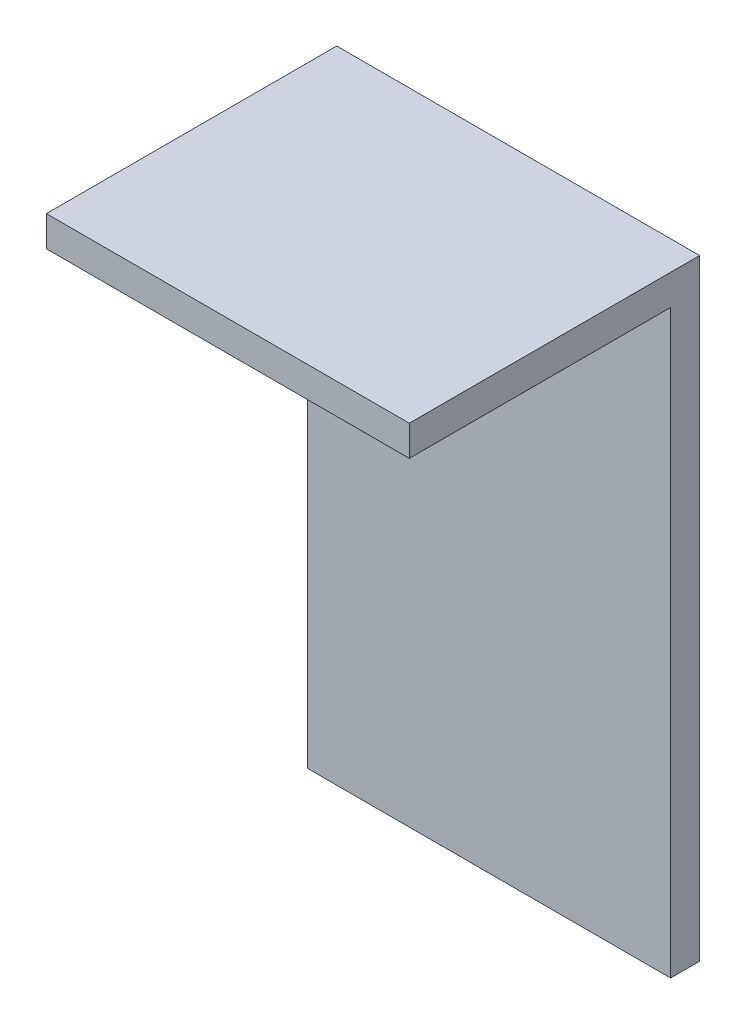
ISO-10303-21;
HEADER;
FILE_DESCRIPTION(('STEP AP214'),'2;1');
FILE_NAME('part.step','',(''),(''),'','','');
FILE_SCHEMA(('AUTOMOTIVE_DESIGN { 1 0 10303 214 1 1 1 1 }'));
ENDSEC;
DATA;
#1=APPLICATION_CONTEXT('core data for automotive mechanical design processes');
#2=APPLICATION_PROTOCOL_DEFINITION('international standard','automotive_design',2000,#1);
#3=PRODUCT_CONTEXT('',#1,'mechanical');
#4=PRODUCT('Part','Part','',(#3));
#5=PRODUCT_RELATED_PRODUCT_CATEGORY('part','',(#4));
#6=PRODUCT_DEFINITION_FORMATION('','',#4);
#7=PRODUCT_DEFINITION_CONTEXT('part definition',#1,'design');
#8=PRODUCT_DEFINITION('design','',#6,#7);
#9=PRODUCT_DEFINITION_SHAPE('','',#8);
#10=(LENGTH_UNIT() NAMED_UNIT(*) SI_UNIT(.MILLI.,.METRE.));
#11=(NAMED_UNIT(*) PLANE_ANGLE_UNIT() SI_UNIT($,.RADIAN.));
#12=(NAMED_UNIT(*) SI_UNIT($,.STERADIAN.) SOLID_ANGLE_UNIT());
#13=UNCERTAINTY_MEASURE_WITH_UNIT(LENGTH_MEASURE(1.E-05),#10,'distance_accuracy_value','');
#14=(GEOMETRIC_REPRESENTATION_CONTEXT(3) GLOBAL_UNCERTAINTY_ASSIGNED_CONTEXT((#13)) GLOBAL_UNIT_ASSIGNED_CONTEXT((#10,
#11,#12)) REPRESENTATION_CONTEXT('',''));
#15=CARTESIAN_POINT('',(0.,0.,0.));
#16=DIRECTION('',(0.,0.,1.));
#17=DIRECTION('',(1.,0.,0.));
#18=AXIS2_PLACEMENT_3D('',#15,#16,#17);
#19=CARTESIAN_POINT('',(0.221679300404559,1.5105,0.2));
#20=DIRECTION('',(0.,0.,1.));
#21=DIRECTION('',(0.,-1.,0.));
#22=AXIS2_PLACEMENT_3D('',#19,#20,#21);
#23=PLANE('',#22);
#24=DIRECTION('',(0.,-1.,0.));
#25=VECTOR('',#24,1.);
#26=CARTESIAN_POINT('',(0.346679300404559,1.36847101449275,0.2));
#27=LINE('',#26,#25);
#28=CARTESIAN_POINT('',(0.346679300404559,1.521,0.2));
#29=VERTEX_POINT('',#28);
#30=CARTESIAN_POINT('',(0.346679300404559,1.5,0.2));
#31=VERTEX_POINT('',#30);
#32=EDGE_CURVE('E141',#29,#31,#27,.T.);
#33=ORIENTED_EDGE('',*,*,#32,.F.);
#34=DIRECTION('',(1.,0.,0.));
#35=VECTOR('',#34,1.);
#36=CARTESIAN_POINT('',(0.221679300404559,1.521,0.2));
#37=LINE('',#36,#35);
#38=CARTESIAN_POINT('',(0.0966793004045591,1.521,0.2));
#39=VERTEX_POINT('',#38);
#40=EDGE_CURVE('E56',#39,#29,#37,.T.);
#41=ORIENTED_EDGE('',*,*,#40,.F.);
#42=DIRECTION('',(0.,-1.,0.));
#43=VECTOR('',#42,1.);
#44=CARTESIAN_POINT('',(0.0966793004045598,1.36847101449275,0.2));
#45=LINE('',#44,#43);
#46=CARTESIAN_POINT('',(0.0966793004045592,1.5,0.2));
#47=VERTEX_POINT('',#46);
#48=EDGE_CURVE('E161',#39,#47,#45,.T.);
#49=ORIENTED_EDGE('',*,*,#48,.T.);
#50=DIRECTION('',(1.,0.,0.));
#51=VECTOR('',#50,1.);
#52=CARTESIAN_POINT('',(0.221679300404559,1.5,0.2));
#53=LINE('',#52,#51);
#54=EDGE_CURVE('E11',#47,#31,#53,.T.);
#55=ORIENTED_EDGE('',*,*,#54,.T.);
#56=EDGE_LOOP('',(#33,#41,#49,#55));
#57=FACE_BOUND('',#56,.T.);
#58=ADVANCED_FACE('F16',(#57),#23,.T.);
#59=CARTESIAN_POINT('',(0.221679300404559,1.5,0.11));
#60=DIRECTION('',(0.,1.,0.));
#61=DIRECTION('',(1.,0.,0.));
#62=AXIS2_PLACEMENT_3D('',#59,#60,#61);
#63=PLANE('',#62);
#64=DIRECTION('',(0.,0.,-1.));
#65=VECTOR('',#64,1.);
#66=CARTESIAN_POINT('',(0.0966793004045593,1.5,0.0420289855072467));
#67=LINE('',#66,#65);
#68=CARTESIAN_POINT('',(0.0966793004045592,1.5,0.02));
#69=VERTEX_POINT('',#68);
#70=EDGE_CURVE('E120',#47,#69,#67,.T.);
#71=ORIENTED_EDGE('',*,*,#70,.T.);
#72=DIRECTION('',(-1.,0.,0.));
#73=VECTOR('',#72,1.);
#74=CARTESIAN_POINT('',(0.22167930040456,1.5,0.02));
#75=LINE('',#74,#73);
#76=CARTESIAN_POINT('',(0.346679300404559,1.5,0.02));
#77=VERTEX_POINT('',#76);
#78=EDGE_CURVE('E27',#77,#69,#75,.T.);
#79=ORIENTED_EDGE('',*,*,#78,.F.);
#80=DIRECTION('',(0.,0.,-1.));
#81=VECTOR('',#80,1.);
#82=CARTESIAN_POINT('',(0.346679300404559,1.5,0.0420289855072467));
#83=LINE('',#82,#81);
#84=EDGE_CURVE('E140',#31,#77,#83,.T.);
#85=ORIENTED_EDGE('',*,*,#84,.F.);
#86=ORIENTED_EDGE('',*,*,#54,.F.);
#87=EDGE_LOOP('',(#71,#79,#85,#86));
#88=FACE_BOUND('',#87,.T.);
#89=ADVANCED_FACE('F259',(#88),#63,.F.);
#90=CARTESIAN_POINT('',(0.22167930040456,1.3,0.02));
#91=DIRECTION('',(0.,0.,1.));
#92=DIRECTION('',(0.,-1.,0.));
#93=AXIS2_PLACEMENT_3D('',#90,#91,#92);
#94=PLANE('',#93);
#95=DIRECTION('',(0.,-1.,0.));
#96=VECTOR('',#95,1.);
#97=CARTESIAN_POINT('',(0.0966793004045598,1.36847101449275,0.02));
#98=LINE('',#97,#96);
#99=CARTESIAN_POINT('',(0.0966793004045604,1.1,0.02));
#100=VERTEX_POINT('',#99);
#101=EDGE_CURVE('E114',#69,#100,#98,.T.);
#102=ORIENTED_EDGE('',*,*,#101,.T.);
#103=DIRECTION('',(1.,0.,0.));
#104=VECTOR('',#103,1.);
#105=CARTESIAN_POINT('',(0.221679300404561,1.1,0.02));
#106=LINE('',#105,#104);
#107=CARTESIAN_POINT('',(0.346679300404561,1.1,0.02));
#108=VERTEX_POINT('',#107);
#109=EDGE_CURVE('E116',#100,#108,#106,.T.);
#110=ORIENTED_EDGE('',*,*,#109,.T.);
#111=DIRECTION('',(0.,-1.,0.));
#112=VECTOR('',#111,1.);
#113=CARTESIAN_POINT('',(0.346679300404559,1.36847101449275,0.02));
#114=LINE('',#113,#112);
#115=EDGE_CURVE('E20',#77,#108,#114,.T.);
#116=ORIENTED_EDGE('',*,*,#115,.F.);
#117=ORIENTED_EDGE('',*,*,#78,.T.);
#118=EDGE_LOOP('',(#102,#110,#116,#117));
#119=FACE_BOUND('',#118,.T.);
#120=ADVANCED_FACE('F115',(#119),#94,.T.);
#121=CARTESIAN_POINT('',(0.346679300404559,1.36847101449275,0.0420289855072467));
#122=DIRECTION('',(1.,0.,0.));
#123=DIRECTION('',(0.,1.,0.));
#124=AXIS2_PLACEMENT_3D('',#121,#122,#123);
#125=PLANE('',#124);
#126=DIRECTION('',(0.,0.,-1.));
#127=VECTOR('',#126,1.);
#128=CARTESIAN_POINT('',(0.346679300404559,1.521,0.1));
#129=LINE('',#128,#127);
#130=CARTESIAN_POINT('',(0.346679300404559,1.521,0.));
#131=VERTEX_POINT('',#130);
#132=EDGE_CURVE('E147',#29,#131,#129,.T.);
#133=ORIENTED_EDGE('',*,*,#132,.F.);
#134=ORIENTED_EDGE('',*,*,#32,.T.);
#135=ORIENTED_EDGE('',*,*,#84,.T.);
#136=ORIENTED_EDGE('',*,*,#115,.T.);
#137=DIRECTION('',(0.,0.,-1.));
#138=VECTOR('',#137,1.);
#139=CARTESIAN_POINT('',(0.346679300404561,1.1,0.01));
#140=LINE('',#139,#138);
#141=CARTESIAN_POINT('',(0.346679300404561,1.1,0.));
#142=VERTEX_POINT('',#141);
#143=EDGE_CURVE('E127',#108,#142,#140,.T.);
#144=ORIENTED_EDGE('',*,*,#143,.T.);
#145=DIRECTION('',(0.,1.,0.));
#146=VECTOR('',#145,1.);
#147=CARTESIAN_POINT('',(0.346679300404561,1.3105,0.));
#148=LINE('',#147,#146);
#149=EDGE_CURVE('E156',#142,#131,#148,.T.);
#150=ORIENTED_EDGE('',*,*,#149,.T.);
#151=EDGE_LOOP('',(#133,#134,#135,#136,#144,#150));
#152=FACE_BOUND('',#151,.T.);
#153=ADVANCED_FACE('F237',(#152),#125,.T.);
#154=CARTESIAN_POINT('',(0.221679300404559,1.521,0.1));
#155=DIRECTION('',(0.,1.,0.));
#156=DIRECTION('',(1.,0.,0.));
#157=AXIS2_PLACEMENT_3D('',#154,#155,#156);
#158=PLANE('',#157);
#159=ORIENTED_EDGE('',*,*,#40,.T.);
#160=ORIENTED_EDGE('',*,*,#132,.T.);
#161=DIRECTION('',(-1.,0.,0.));
#162=VECTOR('',#161,1.);
#163=CARTESIAN_POINT('',(0.22167930040456,1.521,0.));
#164=LINE('',#163,#162);
#165=CARTESIAN_POINT('',(0.0966793004045591,1.521,0.));
#166=VERTEX_POINT('',#165);
#167=EDGE_CURVE('E138',#131,#166,#164,.T.);
#168=ORIENTED_EDGE('',*,*,#167,.T.);
#169=DIRECTION('',(0.,0.,1.));
#170=VECTOR('',#169,1.);
#171=CARTESIAN_POINT('',(0.0966793004045592,1.521,0.0420289855072467));
#172=LINE('',#171,#170);
#173=EDGE_CURVE('E84',#166,#39,#172,.T.);
#174=ORIENTED_EDGE('',*,*,#173,.T.);
#175=EDGE_LOOP('',(#159,#160,#168,#174));
#176=FACE_BOUND('',#175,.T.);
#177=ADVANCED_FACE('F178',(#176),#158,.T.);
#178=CARTESIAN_POINT('',(0.0966793004045598,1.36847101449275,0.0420289855072467));
#179=DIRECTION('',(1.,0.,0.));
#180=DIRECTION('',(0.,1.,0.));
#181=AXIS2_PLACEMENT_3D('',#178,#179,#180);
#182=PLANE('',#181);
#183=ORIENTED_EDGE('',*,*,#101,.F.);
#184=ORIENTED_EDGE('',*,*,#70,.F.);
#185=ORIENTED_EDGE('',*,*,#48,.F.);
#186=ORIENTED_EDGE('',*,*,#173,.F.);
#187=DIRECTION('',(0.,-1.,0.));
#188=VECTOR('',#187,1.);
#189=CARTESIAN_POINT('',(0.0966793004045591,1.3105,0.));
#190=LINE('',#189,#188);
#191=CARTESIAN_POINT('',(0.0966793004045604,1.1,0.));
#192=VERTEX_POINT('',#191);
#193=EDGE_CURVE('E123',#166,#192,#190,.T.);
#194=ORIENTED_EDGE('',*,*,#193,.T.);
#195=DIRECTION('',(0.,0.,1.));
#196=VECTOR('',#195,1.);
#197=CARTESIAN_POINT('',(0.0966793004045605,1.1,0.01));
#198=LINE('',#197,#196);
#199=EDGE_CURVE('E97',#192,#100,#198,.T.);
#200=ORIENTED_EDGE('',*,*,#199,.T.);
#201=EDGE_LOOP('',(#183,#184,#185,#186,#194,#200));
#202=FACE_BOUND('',#201,.T.);
#203=ADVANCED_FACE('F18',(#202),#182,.F.);
#204=CARTESIAN_POINT('',(0.221679300404561,1.1,0.01));
#205=DIRECTION('',(0.,1.,0.));
#206=DIRECTION('',(0.,0.,-1.));
#207=AXIS2_PLACEMENT_3D('',#204,#205,#206);
#208=PLANE('',#207);
#209=ORIENTED_EDGE('',*,*,#143,.F.);
#210=ORIENTED_EDGE('',*,*,#109,.F.);
#211=ORIENTED_EDGE('',*,*,#199,.F.);
#212=DIRECTION('',(1.,0.,0.));
#213=VECTOR('',#212,1.);
#214=CARTESIAN_POINT('',(0.22167930040456,1.1,0.));
#215=LINE('',#214,#213);
#216=EDGE_CURVE('E135',#192,#142,#215,.T.);
#217=ORIENTED_EDGE('',*,*,#216,.T.);
#218=EDGE_LOOP('',(#209,#210,#211,#217));
#219=FACE_BOUND('',#218,.T.);
#220=ADVANCED_FACE('F126',(#219),#208,.F.);
#221=CARTESIAN_POINT('',(0.22167930040456,1.3105,0.));
#222=DIRECTION('',(0.,0.,1.));
#223=DIRECTION('',(0.,-1.,0.));
#224=AXIS2_PLACEMENT_3D('',#221,#222,#223);
#225=PLANE('',#224);
#226=ORIENTED_EDGE('',*,*,#193,.F.);
#227=ORIENTED_EDGE('',*,*,#167,.F.);
#228=ORIENTED_EDGE('',*,*,#149,.F.);
#229=ORIENTED_EDGE('',*,*,#216,.F.);
#230=EDGE_LOOP('',(#226,#227,#228,#229));
#231=FACE_BOUND('',#230,.T.);
#232=ADVANCED_FACE('F182',(#231),#225,.F.);
#233=CLOSED_SHELL('',(#58,#89,#120,#153,#177,#203,#220,#232));
#234=MANIFOLD_SOLID_BREP('B1',#233);
#235=ADVANCED_BREP_SHAPE_REPRESENTATION('',(#18,#234),#14);
#236=SHAPE_DEFINITION_REPRESENTATION(#9,#235);
ENDSEC;
END-ISO-10303-21;
